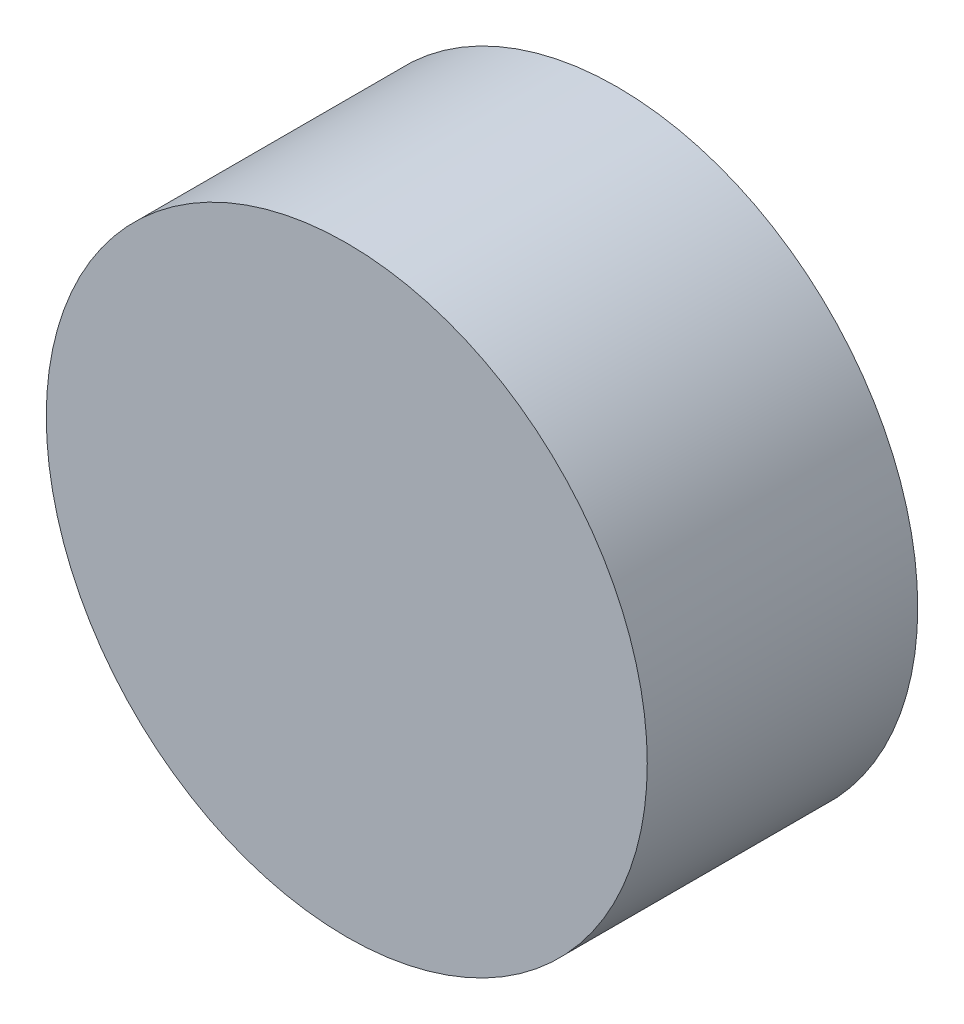
ISO-10303-21;
HEADER;
FILE_DESCRIPTION(('STEP AP214'),'2;1');
FILE_NAME('part.step','',(''),(''),'','','');
FILE_SCHEMA(('AUTOMOTIVE_DESIGN { 1 0 10303 214 1 1 1 1 }'));
ENDSEC;
DATA;
#1=APPLICATION_CONTEXT('core data for automotive mechanical design processes');
#2=APPLICATION_PROTOCOL_DEFINITION('international standard','automotive_design',2000,#1);
#3=PRODUCT_CONTEXT('',#1,'mechanical');
#4=PRODUCT('Part','Part','',(#3));
#5=PRODUCT_RELATED_PRODUCT_CATEGORY('part','',(#4));
#6=PRODUCT_DEFINITION_FORMATION('','',#4);
#7=PRODUCT_DEFINITION_CONTEXT('part definition',#1,'design');
#8=PRODUCT_DEFINITION('design','',#6,#7);
#9=PRODUCT_DEFINITION_SHAPE('','',#8);
#10=(LENGTH_UNIT() NAMED_UNIT(*) SI_UNIT(.MILLI.,.METRE.));
#11=(NAMED_UNIT(*) PLANE_ANGLE_UNIT() SI_UNIT($,.RADIAN.));
#12=(NAMED_UNIT(*) SI_UNIT($,.STERADIAN.) SOLID_ANGLE_UNIT());
#13=UNCERTAINTY_MEASURE_WITH_UNIT(LENGTH_MEASURE(1.E-05),#10,'distance_accuracy_value','');
#14=(GEOMETRIC_REPRESENTATION_CONTEXT(3) GLOBAL_UNCERTAINTY_ASSIGNED_CONTEXT((#13)) GLOBAL_UNIT_ASSIGNED_CONTEXT((#10,
#11,#12)) REPRESENTATION_CONTEXT('',''));
#15=CARTESIAN_POINT('',(0.,0.,0.));
#16=DIRECTION('',(0.,0.,1.));
#17=DIRECTION('',(1.,0.,0.));
#18=AXIS2_PLACEMENT_3D('',#15,#16,#17);
#19=CARTESIAN_POINT('',(0.,-151.009999999999,9.));
#20=DIRECTION('',(0.,0.,-1.));
#21=DIRECTION('',(-1.,0.,0.));
#22=AXIS2_PLACEMENT_3D('',#19,#20,#21);
#23=CYLINDRICAL_SURFACE('',#22,10.);
#24=CARTESIAN_POINT('',(0.,-151.009999999999,9.));
#25=DIRECTION('',(0.,0.,1.));
#26=DIRECTION('',(1.,0.,0.));
#27=AXIS2_PLACEMENT_3D('',#24,#25,#26);
#28=CIRCLE('',#27,10.);
#29=CARTESIAN_POINT('',(10.,-151.009999999999,9.));
#30=VERTEX_POINT('',#29);
#31=EDGE_CURVE('E10',#30,#30,#28,.T.);
#32=ORIENTED_EDGE('',*,*,#31,.F.);
#33=EDGE_LOOP('',(#32));
#34=FACE_BOUND('',#33,.T.);
#35=CARTESIAN_POINT('',(0.,-151.009999999999,0.));
#36=DIRECTION('',(0.,0.,1.));
#37=DIRECTION('',(1.,0.,0.));
#38=AXIS2_PLACEMENT_3D('',#35,#36,#37);
#39=CIRCLE('',#38,10.);
#40=CARTESIAN_POINT('',(10.,-151.009999999999,0.));
#41=VERTEX_POINT('',#40);
#42=EDGE_CURVE('E40',#41,#41,#39,.T.);
#43=ORIENTED_EDGE('',*,*,#42,.T.);
#44=EDGE_LOOP('',(#43));
#45=FACE_BOUND('',#44,.T.);
#46=ADVANCED_FACE('F37',(#34,#45),#23,.T.);
#47=CARTESIAN_POINT('',(0.,-151.009999999999,9.));
#48=DIRECTION('',(0.,0.,1.));
#49=DIRECTION('',(1.,0.,0.));
#50=AXIS2_PLACEMENT_3D('',#47,#48,#49);
#51=PLANE('',#50);
#52=ORIENTED_EDGE('',*,*,#31,.T.);
#53=EDGE_LOOP('',(#52));
#54=FACE_BOUND('',#53,.T.);
#55=ADVANCED_FACE('F52',(#54),#51,.T.);
#56=CARTESIAN_POINT('',(0.,-151.009999999999,0.));
#57=DIRECTION('',(0.,0.,1.));
#58=DIRECTION('',(1.,0.,0.));
#59=AXIS2_PLACEMENT_3D('',#56,#57,#58);
#60=PLANE('',#59);
#61=ORIENTED_EDGE('',*,*,#42,.F.);
#62=EDGE_LOOP('',(#61));
#63=FACE_BOUND('',#62,.T.);
#64=ADVANCED_FACE('F50',(#63),#60,.F.);
#65=CLOSED_SHELL('',(#46,#55,#64));
#66=MANIFOLD_SOLID_BREP('B2',#65);
#67=ADVANCED_BREP_SHAPE_REPRESENTATION('',(#18,#66),#14);
#68=SHAPE_DEFINITION_REPRESENTATION(#9,#67);
ENDSEC;
END-ISO-10303-21;
